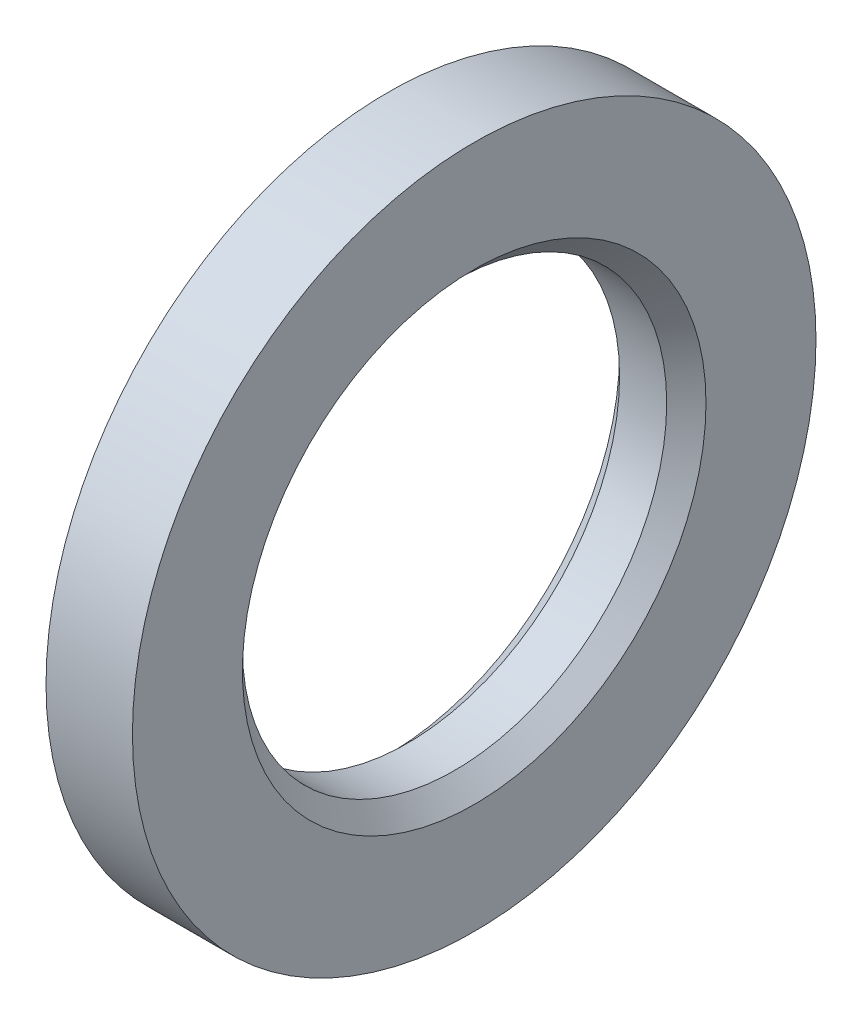
ISO-10303-21;
HEADER;
FILE_DESCRIPTION(('STEP AP214'),'2;1');
FILE_NAME('part.step','',(''),(''),'','','');
FILE_SCHEMA(('AUTOMOTIVE_DESIGN { 1 0 10303 214 1 1 1 1 }'));
ENDSEC;
DATA;
#1=APPLICATION_CONTEXT('core data for automotive mechanical design processes');
#2=APPLICATION_PROTOCOL_DEFINITION('international standard','automotive_design',2000,#1);
#3=PRODUCT_CONTEXT('',#1,'mechanical');
#4=PRODUCT('Part','Part','',(#3));
#5=PRODUCT_RELATED_PRODUCT_CATEGORY('part','',(#4));
#6=PRODUCT_DEFINITION_FORMATION('','',#4);
#7=PRODUCT_DEFINITION_CONTEXT('part definition',#1,'design');
#8=PRODUCT_DEFINITION('design','',#6,#7);
#9=PRODUCT_DEFINITION_SHAPE('','',#8);
#10=(LENGTH_UNIT() NAMED_UNIT(*) SI_UNIT(.MILLI.,.METRE.));
#11=(NAMED_UNIT(*) PLANE_ANGLE_UNIT() SI_UNIT($,.RADIAN.));
#12=(NAMED_UNIT(*) SI_UNIT($,.STERADIAN.) SOLID_ANGLE_UNIT());
#13=UNCERTAINTY_MEASURE_WITH_UNIT(LENGTH_MEASURE(1.E-05),#10,'distance_accuracy_value','');
#14=(GEOMETRIC_REPRESENTATION_CONTEXT(3) GLOBAL_UNCERTAINTY_ASSIGNED_CONTEXT((#13)) GLOBAL_UNIT_ASSIGNED_CONTEXT((#10,
#11,#12)) REPRESENTATION_CONTEXT('',''));
#15=CARTESIAN_POINT('',(0.,0.,0.));
#16=DIRECTION('',(0.,0.,1.));
#17=DIRECTION('',(1.,0.,0.));
#18=AXIS2_PLACEMENT_3D('',#15,#16,#17);
#19=CARTESIAN_POINT('',(-0.0635000000000003,0.,0.));
#20=DIRECTION('',(1.,0.,0.));
#21=DIRECTION('',(0.,0.,-1.));
#22=AXIS2_PLACEMENT_3D('',#19,#20,#21);
#23=CONICAL_SURFACE('',#22,0.6858,0.785398163397446);
#24=CARTESIAN_POINT('',(0.,0.,0.));
#25=DIRECTION('',(1.,0.,0.));
#26=DIRECTION('',(0.,0.,-1.));
#27=AXIS2_PLACEMENT_3D('',#24,#25,#26);
#28=CIRCLE('',#27,0.7493);
#29=CARTESIAN_POINT('',(0.,0.,-0.7493));
#30=VERTEX_POINT('',#29);
#31=EDGE_CURVE('E69',#30,#30,#28,.T.);
#32=ORIENTED_EDGE('',*,*,#31,.T.);
#33=EDGE_LOOP('',(#32));
#34=FACE_BOUND('',#33,.T.);
#35=CARTESIAN_POINT('',(-0.0635000000000003,0.,0.));
#36=DIRECTION('',(1.,0.,0.));
#37=DIRECTION('',(0.,0.,-1.));
#38=AXIS2_PLACEMENT_3D('',#35,#36,#37);
#39=CIRCLE('',#38,0.6858);
#40=CARTESIAN_POINT('',(-0.0635000000000003,0.,-0.6858));
#41=VERTEX_POINT('',#40);
#42=EDGE_CURVE('E10',#41,#41,#39,.T.);
#43=ORIENTED_EDGE('',*,*,#42,.F.);
#44=EDGE_LOOP('',(#43));
#45=FACE_BOUND('',#44,.T.);
#46=ADVANCED_FACE('F40',(#34,#45),#23,.F.);
#47=CARTESIAN_POINT('',(-0.2794,0.,0.));
#48=DIRECTION('',(1.,0.,0.));
#49=DIRECTION('',(0.,0.,-1.));
#50=AXIS2_PLACEMENT_3D('',#47,#48,#49);
#51=CYLINDRICAL_SURFACE('',#50,0.6858);
#52=ORIENTED_EDGE('',*,*,#42,.T.);
#53=EDGE_LOOP('',(#52));
#54=FACE_BOUND('',#53,.T.);
#55=CARTESIAN_POINT('',(-0.2159,0.,0.));
#56=DIRECTION('',(1.,0.,0.));
#57=DIRECTION('',(0.,0.,-1.));
#58=AXIS2_PLACEMENT_3D('',#55,#56,#57);
#59=CIRCLE('',#58,0.6858);
#60=CARTESIAN_POINT('',(-0.2159,0.,-0.6858));
#61=VERTEX_POINT('',#60);
#62=EDGE_CURVE('E47',#61,#61,#59,.T.);
#63=ORIENTED_EDGE('',*,*,#62,.F.);
#64=EDGE_LOOP('',(#63));
#65=FACE_BOUND('',#64,.T.);
#66=ADVANCED_FACE('F89',(#54,#65),#51,.F.);
#67=CARTESIAN_POINT('',(-0.2794,0.,0.));
#68=DIRECTION('',(-1.,0.,0.));
#69=DIRECTION('',(0.,0.,1.));
#70=AXIS2_PLACEMENT_3D('',#67,#68,#69);
#71=CONICAL_SURFACE('',#70,0.7493,0.785398163397448);
#72=ORIENTED_EDGE('',*,*,#62,.T.);
#73=EDGE_LOOP('',(#72));
#74=FACE_BOUND('',#73,.T.);
#75=CARTESIAN_POINT('',(-0.2794,0.,0.));
#76=DIRECTION('',(1.,0.,0.));
#77=DIRECTION('',(0.,0.,-1.));
#78=AXIS2_PLACEMENT_3D('',#75,#76,#77);
#79=CIRCLE('',#78,0.7493);
#80=CARTESIAN_POINT('',(-0.2794,0.,-0.7493));
#81=VERTEX_POINT('',#80);
#82=EDGE_CURVE('E53',#81,#81,#79,.T.);
#83=ORIENTED_EDGE('',*,*,#82,.F.);
#84=EDGE_LOOP('',(#83));
#85=FACE_BOUND('',#84,.T.);
#86=ADVANCED_FACE('F93',(#74,#85),#71,.F.);
#87=CARTESIAN_POINT('',(-0.2794,1.1049,0.));
#88=DIRECTION('',(-1.,0.,0.));
#89=DIRECTION('',(0.,0.,1.));
#90=AXIS2_PLACEMENT_3D('',#87,#88,#89);
#91=PLANE('',#90);
#92=ORIENTED_EDGE('',*,*,#82,.T.);
#93=EDGE_LOOP('',(#92));
#94=FACE_BOUND('',#93,.T.);
#95=CARTESIAN_POINT('',(-0.2794,0.,0.));
#96=DIRECTION('',(1.,0.,0.));
#97=DIRECTION('',(0.,0.,-1.));
#98=AXIS2_PLACEMENT_3D('',#95,#96,#97);
#99=CIRCLE('',#98,1.1049);
#100=CARTESIAN_POINT('',(-0.2794,0.,-1.1049));
#101=VERTEX_POINT('',#100);
#102=EDGE_CURVE('E59',#101,#101,#99,.T.);
#103=ORIENTED_EDGE('',*,*,#102,.F.);
#104=EDGE_LOOP('',(#103));
#105=FACE_BOUND('',#104,.T.);
#106=ADVANCED_FACE('F85',(#94,#105),#91,.T.);
#107=CARTESIAN_POINT('',(-0.2794,0.,0.));
#108=DIRECTION('',(1.,0.,0.));
#109=DIRECTION('',(0.,0.,-1.));
#110=AXIS2_PLACEMENT_3D('',#107,#108,#109);
#111=CYLINDRICAL_SURFACE('',#110,1.1049);
#112=ORIENTED_EDGE('',*,*,#102,.T.);
#113=EDGE_LOOP('',(#112));
#114=FACE_BOUND('',#113,.T.);
#115=CARTESIAN_POINT('',(0.,0.,0.));
#116=DIRECTION('',(1.,0.,0.));
#117=DIRECTION('',(0.,0.,-1.));
#118=AXIS2_PLACEMENT_3D('',#115,#116,#117);
#119=CIRCLE('',#118,1.1049);
#120=CARTESIAN_POINT('',(0.,0.,-1.1049));
#121=VERTEX_POINT('',#120);
#122=EDGE_CURVE('E65',#121,#121,#119,.T.);
#123=ORIENTED_EDGE('',*,*,#122,.F.);
#124=EDGE_LOOP('',(#123));
#125=FACE_BOUND('',#124,.T.);
#126=ADVANCED_FACE('F79',(#114,#125),#111,.T.);
#127=CARTESIAN_POINT('',(0.,0.7493,0.));
#128=DIRECTION('',(1.,0.,0.));
#129=DIRECTION('',(0.,0.,-1.));
#130=AXIS2_PLACEMENT_3D('',#127,#128,#129);
#131=PLANE('',#130);
#132=ORIENTED_EDGE('',*,*,#122,.T.);
#133=EDGE_LOOP('',(#132));
#134=FACE_BOUND('',#133,.T.);
#135=ORIENTED_EDGE('',*,*,#31,.F.);
#136=EDGE_LOOP('',(#135));
#137=FACE_BOUND('',#136,.T.);
#138=ADVANCED_FACE('F77',(#134,#137),#131,.T.);
#139=CLOSED_SHELL('',(#46,#66,#86,#106,#126,#138));
#140=MANIFOLD_SOLID_BREP('B2',#139);
#141=ADVANCED_BREP_SHAPE_REPRESENTATION('',(#18,#140),#14);
#142=SHAPE_DEFINITION_REPRESENTATION(#9,#141);
ENDSEC;
END-ISO-10303-21;
